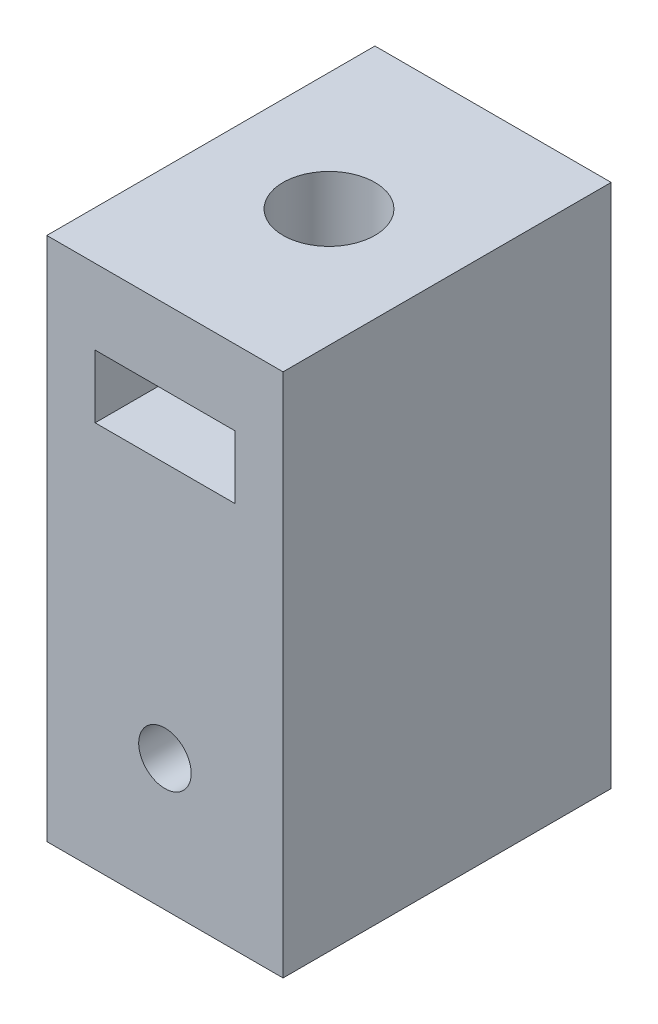
ISO-10303-21;
HEADER;
FILE_DESCRIPTION(('STEP AP214'),'2;1');
FILE_NAME('part.step','',(''),(''),'','','');
FILE_SCHEMA(('AUTOMOTIVE_DESIGN { 1 0 10303 214 1 1 1 1 }'));
ENDSEC;
DATA;
#1=APPLICATION_CONTEXT('core data for automotive mechanical design processes');
#2=APPLICATION_PROTOCOL_DEFINITION('international standard','automotive_design',2000,#1);
#3=PRODUCT_CONTEXT('',#1,'mechanical');
#4=PRODUCT('Part','Part','',(#3));
#5=PRODUCT_RELATED_PRODUCT_CATEGORY('part','',(#4));
#6=PRODUCT_DEFINITION_FORMATION('','',#4);
#7=PRODUCT_DEFINITION_CONTEXT('part definition',#1,'design');
#8=PRODUCT_DEFINITION('design','',#6,#7);
#9=PRODUCT_DEFINITION_SHAPE('','',#8);
#10=(LENGTH_UNIT() NAMED_UNIT(*) SI_UNIT(.MILLI.,.METRE.));
#11=(NAMED_UNIT(*) PLANE_ANGLE_UNIT() SI_UNIT($,.RADIAN.));
#12=(NAMED_UNIT(*) SI_UNIT($,.STERADIAN.) SOLID_ANGLE_UNIT());
#13=UNCERTAINTY_MEASURE_WITH_UNIT(LENGTH_MEASURE(1.E-05),#10,'distance_accuracy_value','');
#14=(GEOMETRIC_REPRESENTATION_CONTEXT(3) GLOBAL_UNCERTAINTY_ASSIGNED_CONTEXT((#13)) GLOBAL_UNIT_ASSIGNED_CONTEXT((#10,
#11,#12)) REPRESENTATION_CONTEXT('',''));
#15=CARTESIAN_POINT('',(0.,0.,0.));
#16=DIRECTION('',(0.,0.,1.));
#17=DIRECTION('',(1.,0.,0.));
#18=AXIS2_PLACEMENT_3D('',#15,#16,#17);
#19=CARTESIAN_POINT('',(4.5,20.,6.25));
#20=DIRECTION('',(-1.,0.,0.));
#21=DIRECTION('',(0.,0.,1.));
#22=AXIS2_PLACEMENT_3D('',#19,#20,#21);
#23=PLANE('',#22);
#24=DIRECTION('',(0.,0.,-1.));
#25=VECTOR('',#24,1.);
#26=CARTESIAN_POINT('',(4.5,0.,6.25));
#27=LINE('',#26,#25);
#28=CARTESIAN_POINT('',(4.5,0.,6.25));
#29=VERTEX_POINT('',#28);
#30=CARTESIAN_POINT('',(4.5,0.,-6.25));
#31=VERTEX_POINT('',#30);
#32=EDGE_CURVE('E161',#29,#31,#27,.T.);
#33=ORIENTED_EDGE('',*,*,#32,.T.);
#34=DIRECTION('',(0.,-1.,0.));
#35=VECTOR('',#34,1.);
#36=CARTESIAN_POINT('',(4.5,20.,-6.25));
#37=LINE('',#36,#35);
#38=CARTESIAN_POINT('',(4.5,20.,-6.25));
#39=VERTEX_POINT('',#38);
#40=EDGE_CURVE('E11',#39,#31,#37,.T.);
#41=ORIENTED_EDGE('',*,*,#40,.F.);
#42=DIRECTION('',(0.,0.,-1.));
#43=VECTOR('',#42,1.);
#44=CARTESIAN_POINT('',(4.5,20.,6.25));
#45=LINE('',#44,#43);
#46=CARTESIAN_POINT('',(4.5,20.,6.25));
#47=VERTEX_POINT('',#46);
#48=EDGE_CURVE('E165',#47,#39,#45,.T.);
#49=ORIENTED_EDGE('',*,*,#48,.F.);
#50=DIRECTION('',(0.,-1.,0.));
#51=VECTOR('',#50,1.);
#52=CARTESIAN_POINT('',(4.5,20.,6.25));
#53=LINE('',#52,#51);
#54=EDGE_CURVE('E179',#47,#29,#53,.T.);
#55=ORIENTED_EDGE('',*,*,#54,.T.);
#56=EDGE_LOOP('',(#33,#41,#49,#55));
#57=FACE_BOUND('',#56,.T.);
#58=ADVANCED_FACE('F39',(#57),#23,.F.);
#59=CARTESIAN_POINT('',(-4.5,20.,-6.25));
#60=DIRECTION('',(0.,0.,1.));
#61=DIRECTION('',(1.,0.,0.));
#62=AXIS2_PLACEMENT_3D('',#59,#60,#61);
#63=PLANE('',#62);
#64=DIRECTION('',(-1.,0.,0.));
#65=VECTOR('',#64,1.);
#66=CARTESIAN_POINT('',(-2.66,17.137634849752,-6.25));
#67=LINE('',#66,#65);
#68=CARTESIAN_POINT('',(2.66,17.137634849752,-6.25));
#69=VERTEX_POINT('',#68);
#70=CARTESIAN_POINT('',(-2.66,17.137634849752,-6.25));
#71=VERTEX_POINT('',#70);
#72=EDGE_CURVE('E114',#69,#71,#67,.T.);
#73=ORIENTED_EDGE('',*,*,#72,.T.);
#74=DIRECTION('',(0.,-1.,0.));
#75=VECTOR('',#74,1.);
#76=CARTESIAN_POINT('',(-2.66,17.137634849752,-6.25));
#77=LINE('',#76,#75);
#78=CARTESIAN_POINT('',(-2.66,14.737634849752,-6.25));
#79=VERTEX_POINT('',#78);
#80=EDGE_CURVE('E107',#71,#79,#77,.T.);
#81=ORIENTED_EDGE('',*,*,#80,.T.);
#82=DIRECTION('',(1.,0.,0.));
#83=VECTOR('',#82,1.);
#84=CARTESIAN_POINT('',(-2.66,14.737634849752,-6.25));
#85=LINE('',#84,#83);
#86=CARTESIAN_POINT('',(2.66,14.737634849752,-6.25));
#87=VERTEX_POINT('',#86);
#88=EDGE_CURVE('E117',#79,#87,#85,.T.);
#89=ORIENTED_EDGE('',*,*,#88,.T.);
#90=DIRECTION('',(0.,1.,0.));
#91=VECTOR('',#90,1.);
#92=CARTESIAN_POINT('',(2.66,17.137634849752,-6.25));
#93=LINE('',#92,#91);
#94=EDGE_CURVE('E55',#87,#69,#93,.T.);
#95=ORIENTED_EDGE('',*,*,#94,.T.);
#96=EDGE_LOOP('',(#73,#81,#89,#95));
#97=FACE_BOUND('',#96,.T.);
#98=CARTESIAN_POINT('',(0.,5.,-6.25));
#99=DIRECTION('',(0.,0.,1.));
#100=DIRECTION('',(1.,0.,0.));
#101=AXIS2_PLACEMENT_3D('',#98,#99,#100);
#102=CIRCLE('',#101,1.);
#103=CARTESIAN_POINT('',(1.,5.,-6.25));
#104=VERTEX_POINT('',#103);
#105=EDGE_CURVE('E157',#104,#104,#102,.T.);
#106=ORIENTED_EDGE('',*,*,#105,.T.);
#107=EDGE_LOOP('',(#106));
#108=FACE_BOUND('',#107,.T.);
#109=DIRECTION('',(-1.,0.,0.));
#110=VECTOR('',#109,1.);
#111=CARTESIAN_POINT('',(-4.5,0.,-6.25));
#112=LINE('',#111,#110);
#113=CARTESIAN_POINT('',(-4.5,0.,-6.25));
#114=VERTEX_POINT('',#113);
#115=EDGE_CURVE('E183',#31,#114,#112,.T.);
#116=ORIENTED_EDGE('',*,*,#115,.T.);
#117=DIRECTION('',(0.,-1.,0.));
#118=VECTOR('',#117,1.);
#119=CARTESIAN_POINT('',(-4.5,20.,-6.25));
#120=LINE('',#119,#118);
#121=CARTESIAN_POINT('',(-4.5,20.,-6.25));
#122=VERTEX_POINT('',#121);
#123=EDGE_CURVE('E48',#122,#114,#120,.T.);
#124=ORIENTED_EDGE('',*,*,#123,.F.);
#125=DIRECTION('',(-1.,0.,0.));
#126=VECTOR('',#125,1.);
#127=CARTESIAN_POINT('',(-4.5,20.,-6.25));
#128=LINE('',#127,#126);
#129=EDGE_CURVE('E169',#39,#122,#128,.T.);
#130=ORIENTED_EDGE('',*,*,#129,.F.);
#131=ORIENTED_EDGE('',*,*,#40,.T.);
#132=EDGE_LOOP('',(#116,#124,#130,#131));
#133=FACE_BOUND('',#132,.T.);
#134=ADVANCED_FACE('F122',(#97,#108,#133),#63,.F.);
#135=CARTESIAN_POINT('',(-4.5,20.,6.25));
#136=DIRECTION('',(1.,0.,0.));
#137=DIRECTION('',(0.,0.,-1.));
#138=AXIS2_PLACEMENT_3D('',#135,#136,#137);
#139=PLANE('',#138);
#140=DIRECTION('',(0.,0.,1.));
#141=VECTOR('',#140,1.);
#142=CARTESIAN_POINT('',(-4.5,0.,6.25));
#143=LINE('',#142,#141);
#144=CARTESIAN_POINT('',(-4.5,0.,6.25));
#145=VERTEX_POINT('',#144);
#146=EDGE_CURVE('E186',#114,#145,#143,.T.);
#147=ORIENTED_EDGE('',*,*,#146,.T.);
#148=DIRECTION('',(0.,-1.,0.));
#149=VECTOR('',#148,1.);
#150=CARTESIAN_POINT('',(-4.5,20.,6.25));
#151=LINE('',#150,#149);
#152=CARTESIAN_POINT('',(-4.5,20.,6.25));
#153=VERTEX_POINT('',#152);
#154=EDGE_CURVE('E194',#153,#145,#151,.T.);
#155=ORIENTED_EDGE('',*,*,#154,.F.);
#156=DIRECTION('',(0.,0.,1.));
#157=VECTOR('',#156,1.);
#158=CARTESIAN_POINT('',(-4.5,20.,6.25));
#159=LINE('',#158,#157);
#160=EDGE_CURVE('E173',#122,#153,#159,.T.);
#161=ORIENTED_EDGE('',*,*,#160,.F.);
#162=ORIENTED_EDGE('',*,*,#123,.T.);
#163=EDGE_LOOP('',(#147,#155,#161,#162));
#164=FACE_BOUND('',#163,.T.);
#165=ADVANCED_FACE('F204',(#164),#139,.F.);
#166=CARTESIAN_POINT('',(-4.5,20.,6.25));
#167=DIRECTION('',(0.,0.,-1.));
#168=DIRECTION('',(-1.,0.,0.));
#169=AXIS2_PLACEMENT_3D('',#166,#167,#168);
#170=PLANE('',#169);
#171=DIRECTION('',(1.,0.,0.));
#172=VECTOR('',#171,1.);
#173=CARTESIAN_POINT('',(-2.66,14.737634849752,6.25));
#174=LINE('',#173,#172);
#175=CARTESIAN_POINT('',(-2.66,14.737634849752,6.25));
#176=VERTEX_POINT('',#175);
#177=CARTESIAN_POINT('',(2.66,14.737634849752,6.25));
#178=VERTEX_POINT('',#177);
#179=EDGE_CURVE('E142',#176,#178,#174,.T.);
#180=ORIENTED_EDGE('',*,*,#179,.F.);
#181=DIRECTION('',(0.,-1.,0.));
#182=VECTOR('',#181,1.);
#183=CARTESIAN_POINT('',(-2.66,17.137634849752,6.25));
#184=LINE('',#183,#182);
#185=CARTESIAN_POINT('',(-2.66,17.137634849752,6.25));
#186=VERTEX_POINT('',#185);
#187=EDGE_CURVE('E63',#186,#176,#184,.T.);
#188=ORIENTED_EDGE('',*,*,#187,.F.);
#189=DIRECTION('',(-1.,0.,0.));
#190=VECTOR('',#189,1.);
#191=CARTESIAN_POINT('',(-2.66,17.137634849752,6.25));
#192=LINE('',#191,#190);
#193=CARTESIAN_POINT('',(2.66,17.137634849752,6.25));
#194=VERTEX_POINT('',#193);
#195=EDGE_CURVE('E126',#194,#186,#192,.T.);
#196=ORIENTED_EDGE('',*,*,#195,.F.);
#197=DIRECTION('',(0.,1.,0.));
#198=VECTOR('',#197,1.);
#199=CARTESIAN_POINT('',(2.66,17.137634849752,6.25));
#200=LINE('',#199,#198);
#201=EDGE_CURVE('E130',#178,#194,#200,.T.);
#202=ORIENTED_EDGE('',*,*,#201,.F.);
#203=EDGE_LOOP('',(#180,#188,#196,#202));
#204=FACE_BOUND('',#203,.T.);
#205=CARTESIAN_POINT('',(0.,5.,6.25));
#206=DIRECTION('',(0.,0.,1.));
#207=DIRECTION('',(1.,0.,0.));
#208=AXIS2_PLACEMENT_3D('',#205,#206,#207);
#209=CIRCLE('',#208,1.);
#210=CARTESIAN_POINT('',(1.,5.,6.25));
#211=VERTEX_POINT('',#210);
#212=EDGE_CURVE('E151',#211,#211,#209,.T.);
#213=ORIENTED_EDGE('',*,*,#212,.F.);
#214=EDGE_LOOP('',(#213));
#215=FACE_BOUND('',#214,.T.);
#216=DIRECTION('',(1.,0.,0.));
#217=VECTOR('',#216,1.);
#218=CARTESIAN_POINT('',(-4.5,0.,6.25));
#219=LINE('',#218,#217);
#220=EDGE_CURVE('E170',#145,#29,#219,.T.);
#221=ORIENTED_EDGE('',*,*,#220,.T.);
#222=ORIENTED_EDGE('',*,*,#54,.F.);
#223=DIRECTION('',(1.,0.,0.));
#224=VECTOR('',#223,1.);
#225=CARTESIAN_POINT('',(-4.5,20.,6.25));
#226=LINE('',#225,#224);
#227=EDGE_CURVE('E176',#153,#47,#226,.T.);
#228=ORIENTED_EDGE('',*,*,#227,.F.);
#229=ORIENTED_EDGE('',*,*,#154,.T.);
#230=EDGE_LOOP('',(#221,#222,#228,#229));
#231=FACE_BOUND('',#230,.T.);
#232=ADVANCED_FACE('F213',(#204,#215,#231),#170,.F.);
#233=CARTESIAN_POINT('',(0.,20.,0.));
#234=DIRECTION('',(0.,-1.,0.));
#235=DIRECTION('',(0.,0.,-1.));
#236=AXIS2_PLACEMENT_3D('',#233,#234,#235);
#237=PLANE('',#236);
#238=CARTESIAN_POINT('',(0.,20.,0.));
#239=DIRECTION('',(0.,1.,0.));
#240=DIRECTION('',(0.,0.,1.));
#241=AXIS2_PLACEMENT_3D('',#238,#239,#240);
#242=CIRCLE('',#241,1.75);
#243=CARTESIAN_POINT('',(0.,20.,1.75));
#244=VERTEX_POINT('',#243);
#245=EDGE_CURVE('E267',#244,#244,#242,.T.);
#246=ORIENTED_EDGE('',*,*,#245,.F.);
#247=EDGE_LOOP('',(#246));
#248=FACE_BOUND('',#247,.T.);
#249=ORIENTED_EDGE('',*,*,#48,.T.);
#250=ORIENTED_EDGE('',*,*,#129,.T.);
#251=ORIENTED_EDGE('',*,*,#160,.T.);
#252=ORIENTED_EDGE('',*,*,#227,.T.);
#253=EDGE_LOOP('',(#249,#250,#251,#252));
#254=FACE_BOUND('',#253,.T.);
#255=ADVANCED_FACE('F219',(#248,#254),#237,.F.);
#256=CARTESIAN_POINT('',(0.,0.,0.));
#257=DIRECTION('',(0.,-1.,0.));
#258=DIRECTION('',(0.,0.,-1.));
#259=AXIS2_PLACEMENT_3D('',#256,#257,#258);
#260=PLANE('',#259);
#261=ORIENTED_EDGE('',*,*,#32,.F.);
#262=ORIENTED_EDGE('',*,*,#220,.F.);
#263=ORIENTED_EDGE('',*,*,#146,.F.);
#264=ORIENTED_EDGE('',*,*,#115,.F.);
#265=EDGE_LOOP('',(#261,#262,#263,#264));
#266=FACE_BOUND('',#265,.T.);
#267=ADVANCED_FACE('F210',(#266),#260,.T.);
#268=CARTESIAN_POINT('',(0.,5.,-6.25));
#269=DIRECTION('',(0.,0.,1.));
#270=DIRECTION('',(1.,0.,0.));
#271=AXIS2_PLACEMENT_3D('',#268,#269,#270);
#272=CYLINDRICAL_SURFACE('',#271,1.);
#273=ORIENTED_EDGE('',*,*,#105,.F.);
#274=EDGE_LOOP('',(#273));
#275=FACE_BOUND('',#274,.T.);
#276=ORIENTED_EDGE('',*,*,#212,.T.);
#277=EDGE_LOOP('',(#276));
#278=FACE_BOUND('',#277,.T.);
#279=ADVANCED_FACE('F232',(#275,#278),#272,.F.);
#280=CARTESIAN_POINT('',(-2.66,17.137634849752,-6.25));
#281=DIRECTION('',(-1.,0.,0.));
#282=DIRECTION('',(0.,-1.,0.));
#283=AXIS2_PLACEMENT_3D('',#280,#281,#282);
#284=PLANE('',#283);
#285=ORIENTED_EDGE('',*,*,#187,.T.);
#286=DIRECTION('',(0.,0.,1.));
#287=VECTOR('',#286,1.);
#288=CARTESIAN_POINT('',(-2.66,14.737634849752,-6.25));
#289=LINE('',#288,#287);
#290=EDGE_CURVE('E103',#79,#176,#289,.T.);
#291=ORIENTED_EDGE('',*,*,#290,.F.);
#292=ORIENTED_EDGE('',*,*,#80,.F.);
#293=DIRECTION('',(0.,0.,1.));
#294=VECTOR('',#293,1.);
#295=CARTESIAN_POINT('',(-2.66,17.137634849752,-6.25));
#296=LINE('',#295,#294);
#297=EDGE_CURVE('E148',#71,#186,#296,.T.);
#298=ORIENTED_EDGE('',*,*,#297,.T.);
#299=EDGE_LOOP('',(#285,#291,#292,#298));
#300=FACE_BOUND('',#299,.T.);
#301=ADVANCED_FACE('F105',(#300),#284,.F.);
#302=CARTESIAN_POINT('',(-2.66,17.137634849752,-6.25));
#303=DIRECTION('',(0.,1.,0.));
#304=DIRECTION('',(0.,0.,1.));
#305=AXIS2_PLACEMENT_3D('',#302,#303,#304);
#306=PLANE('',#305);
#307=CARTESIAN_POINT('',(0.,17.137634849752,0.));
#308=DIRECTION('',(0.,1.,0.));
#309=DIRECTION('',(0.,0.,1.));
#310=AXIS2_PLACEMENT_3D('',#307,#308,#309);
#311=CIRCLE('',#310,1.75);
#312=CARTESIAN_POINT('',(0.,17.137634849752,1.75));
#313=VERTEX_POINT('',#312);
#314=EDGE_CURVE('E133',#313,#313,#311,.T.);
#315=ORIENTED_EDGE('',*,*,#314,.T.);
#316=EDGE_LOOP('',(#315));
#317=FACE_BOUND('',#316,.T.);
#318=ORIENTED_EDGE('',*,*,#195,.T.);
#319=ORIENTED_EDGE('',*,*,#297,.F.);
#320=ORIENTED_EDGE('',*,*,#72,.F.);
#321=DIRECTION('',(0.,0.,1.));
#322=VECTOR('',#321,1.);
#323=CARTESIAN_POINT('',(2.66,17.137634849752,-6.25));
#324=LINE('',#323,#322);
#325=EDGE_CURVE('E152',#69,#194,#324,.T.);
#326=ORIENTED_EDGE('',*,*,#325,.T.);
#327=EDGE_LOOP('',(#318,#319,#320,#326));
#328=FACE_BOUND('',#327,.T.);
#329=ADVANCED_FACE('F241',(#317,#328),#306,.F.);
#330=CARTESIAN_POINT('',(2.66,17.137634849752,-6.25));
#331=DIRECTION('',(1.,0.,0.));
#332=DIRECTION('',(0.,1.,0.));
#333=AXIS2_PLACEMENT_3D('',#330,#331,#332);
#334=PLANE('',#333);
#335=ORIENTED_EDGE('',*,*,#201,.T.);
#336=ORIENTED_EDGE('',*,*,#325,.F.);
#337=ORIENTED_EDGE('',*,*,#94,.F.);
#338=DIRECTION('',(0.,0.,1.));
#339=VECTOR('',#338,1.);
#340=CARTESIAN_POINT('',(2.66,14.737634849752,-6.25));
#341=LINE('',#340,#339);
#342=EDGE_CURVE('E113',#87,#178,#341,.T.);
#343=ORIENTED_EDGE('',*,*,#342,.T.);
#344=EDGE_LOOP('',(#335,#336,#337,#343));
#345=FACE_BOUND('',#344,.T.);
#346=ADVANCED_FACE('F245',(#345),#334,.F.);
#347=CARTESIAN_POINT('',(-2.66,14.737634849752,-6.25));
#348=DIRECTION('',(0.,-1.,0.));
#349=DIRECTION('',(0.,0.,-1.));
#350=AXIS2_PLACEMENT_3D('',#347,#348,#349);
#351=PLANE('',#350);
#352=CARTESIAN_POINT('',(0.,14.737634849752,0.));
#353=DIRECTION('',(0.,-1.,0.));
#354=DIRECTION('',(0.,0.,-1.));
#355=AXIS2_PLACEMENT_3D('',#352,#353,#354);
#356=CIRCLE('',#355,1.75);
#357=CARTESIAN_POINT('',(0.,14.737634849752,-1.75));
#358=VERTEX_POINT('',#357);
#359=EDGE_CURVE('E42',#358,#358,#356,.T.);
#360=ORIENTED_EDGE('',*,*,#359,.T.);
#361=EDGE_LOOP('',(#360));
#362=FACE_BOUND('',#361,.T.);
#363=ORIENTED_EDGE('',*,*,#179,.T.);
#364=ORIENTED_EDGE('',*,*,#342,.F.);
#365=ORIENTED_EDGE('',*,*,#88,.F.);
#366=ORIENTED_EDGE('',*,*,#290,.T.);
#367=EDGE_LOOP('',(#363,#364,#365,#366));
#368=FACE_BOUND('',#367,.T.);
#369=ADVANCED_FACE('F118',(#362,#368),#351,.F.);
#370=CARTESIAN_POINT('',(0.,7.,0.));
#371=DIRECTION('',(0.,1.,0.));
#372=DIRECTION('',(0.,0.,1.));
#373=AXIS2_PLACEMENT_3D('',#370,#371,#372);
#374=PLANE('',#373);
#375=CARTESIAN_POINT('',(0.,7.,0.));
#376=DIRECTION('',(0.,1.,0.));
#377=DIRECTION('',(0.,0.,1.));
#378=AXIS2_PLACEMENT_3D('',#375,#376,#377);
#379=CIRCLE('',#378,1.75);
#380=CARTESIAN_POINT('',(0.,7.,1.75));
#381=VERTEX_POINT('',#380);
#382=EDGE_CURVE('E265',#381,#381,#379,.T.);
#383=ORIENTED_EDGE('',*,*,#382,.T.);
#384=EDGE_LOOP('',(#383));
#385=FACE_BOUND('',#384,.T.);
#386=ADVANCED_FACE('F244',(#385),#374,.T.);
#387=CARTESIAN_POINT('',(0.,7.,0.));
#388=DIRECTION('',(0.,1.,0.));
#389=DIRECTION('',(0.,0.,1.));
#390=AXIS2_PLACEMENT_3D('',#387,#388,#389);
#391=CYLINDRICAL_SURFACE('',#390,1.75);
#392=ORIENTED_EDGE('',*,*,#382,.F.);
#393=EDGE_LOOP('',(#392));
#394=FACE_BOUND('',#393,.T.);
#395=ORIENTED_EDGE('',*,*,#359,.F.);
#396=EDGE_LOOP('',(#395));
#397=FACE_BOUND('',#396,.T.);
#398=ADVANCED_FACE('F255',(#394,#397),#391,.F.);
#399=ORIENTED_EDGE('',*,*,#245,.T.);
#400=EDGE_LOOP('',(#399));
#401=FACE_BOUND('',#400,.T.);
#402=ORIENTED_EDGE('',*,*,#314,.F.);
#403=EDGE_LOOP('',(#402));
#404=FACE_BOUND('',#403,.T.);
#405=ADVANCED_FACE('F252',(#401,#404),#391,.F.);
#406=CLOSED_SHELL('',(#58,#134,#165,#232,#255,#267,#279,#301,#329,#346,#369,#386,#398,#405));
#407=MANIFOLD_SOLID_BREP('B2',#406);
#408=ADVANCED_BREP_SHAPE_REPRESENTATION('',(#18,#407),#14);
#409=SHAPE_DEFINITION_REPRESENTATION(#9,#408);
ENDSEC;
END-ISO-10303-21;
